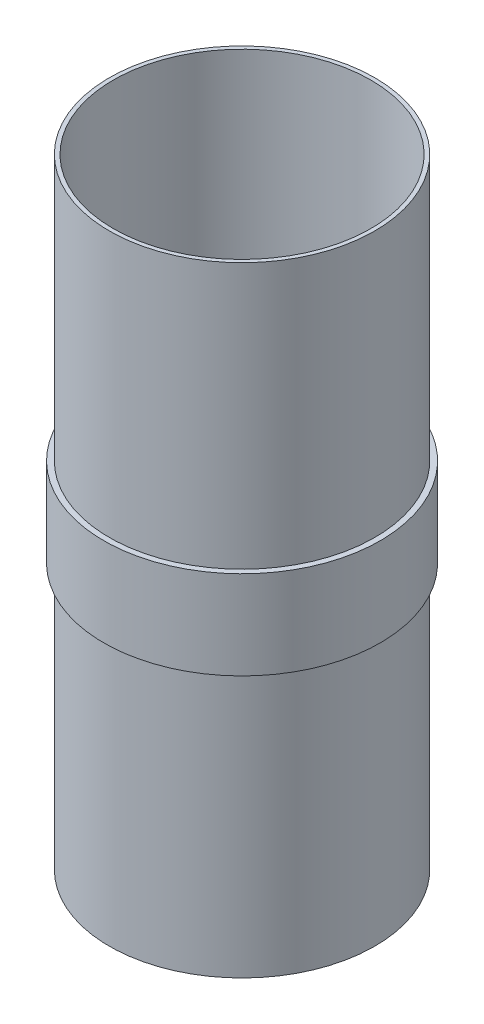
ISO-10303-21;
HEADER;
FILE_DESCRIPTION(('STEP AP214'),'2;1');
FILE_NAME('part.step','',(''),(''),'','','');
FILE_SCHEMA(('AUTOMOTIVE_DESIGN { 1 0 10303 214 1 1 1 1 }'));
ENDSEC;
DATA;
#1=APPLICATION_CONTEXT('core data for automotive mechanical design processes');
#2=APPLICATION_PROTOCOL_DEFINITION('international standard','automotive_design',2000,#1);
#3=PRODUCT_CONTEXT('',#1,'mechanical');
#4=PRODUCT('Part','Part','',(#3));
#5=PRODUCT_RELATED_PRODUCT_CATEGORY('part','',(#4));
#6=PRODUCT_DEFINITION_FORMATION('','',#4);
#7=PRODUCT_DEFINITION_CONTEXT('part definition',#1,'design');
#8=PRODUCT_DEFINITION('design','',#6,#7);
#9=PRODUCT_DEFINITION_SHAPE('','',#8);
#10=(LENGTH_UNIT() NAMED_UNIT(*) SI_UNIT(.MILLI.,.METRE.));
#11=(NAMED_UNIT(*) PLANE_ANGLE_UNIT() SI_UNIT($,.RADIAN.));
#12=(NAMED_UNIT(*) SI_UNIT($,.STERADIAN.) SOLID_ANGLE_UNIT());
#13=UNCERTAINTY_MEASURE_WITH_UNIT(LENGTH_MEASURE(1.E-05),#10,'distance_accuracy_value','');
#14=(GEOMETRIC_REPRESENTATION_CONTEXT(3) GLOBAL_UNCERTAINTY_ASSIGNED_CONTEXT((#13)) GLOBAL_UNIT_ASSIGNED_CONTEXT((#10,
#11,#12)) REPRESENTATION_CONTEXT('',''));
#15=CARTESIAN_POINT('',(0.,0.,0.));
#16=DIRECTION('',(0.,0.,1.));
#17=DIRECTION('',(1.,0.,0.));
#18=AXIS2_PLACEMENT_3D('',#15,#16,#17);
#19=CARTESIAN_POINT('',(73.914,0.,0.));
#20=DIRECTION('',(0.,-1.,0.));
#21=DIRECTION('',(0.,0.,-1.));
#22=AXIS2_PLACEMENT_3D('',#19,#20,#21);
#23=PLANE('',#22);
#24=CARTESIAN_POINT('',(0.,0.,0.));
#25=DIRECTION('',(0.,-1.,0.));
#26=DIRECTION('',(0.,0.,-1.));
#27=AXIS2_PLACEMENT_3D('',#24,#25,#26);
#28=CIRCLE('',#27,76.2);
#29=CARTESIAN_POINT('',(0.,0.,-76.2));
#30=VERTEX_POINT('',#29);
#31=EDGE_CURVE('E10',#30,#30,#28,.T.);
#32=ORIENTED_EDGE('',*,*,#31,.T.);
#33=EDGE_LOOP('',(#32));
#34=FACE_BOUND('',#33,.T.);
#35=CARTESIAN_POINT('',(0.,0.,0.));
#36=DIRECTION('',(0.,-1.,0.));
#37=DIRECTION('',(0.,0.,-1.));
#38=AXIS2_PLACEMENT_3D('',#35,#36,#37);
#39=CIRCLE('',#38,73.914);
#40=CARTESIAN_POINT('',(0.,0.,-73.914));
#41=VERTEX_POINT('',#40);
#42=EDGE_CURVE('E66',#41,#41,#39,.T.);
#43=ORIENTED_EDGE('',*,*,#42,.F.);
#44=EDGE_LOOP('',(#43));
#45=FACE_BOUND('',#44,.T.);
#46=ADVANCED_FACE('F38',(#34,#45),#23,.T.);
#47=CARTESIAN_POINT('',(0.,0.,0.));
#48=DIRECTION('',(0.,-1.,0.));
#49=DIRECTION('',(0.,0.,-1.));
#50=AXIS2_PLACEMENT_3D('',#47,#48,#49);
#51=CYLINDRICAL_SURFACE('',#50,76.2);
#52=CARTESIAN_POINT('',(0.,152.4,0.));
#53=DIRECTION('',(0.,-1.,0.));
#54=DIRECTION('',(0.,0.,-1.));
#55=AXIS2_PLACEMENT_3D('',#52,#53,#54);
#56=CIRCLE('',#55,76.2);
#57=CARTESIAN_POINT('',(0.,152.4,-76.2));
#58=VERTEX_POINT('',#57);
#59=EDGE_CURVE('E44',#58,#58,#56,.T.);
#60=ORIENTED_EDGE('',*,*,#59,.T.);
#61=EDGE_LOOP('',(#60));
#62=FACE_BOUND('',#61,.T.);
#63=ORIENTED_EDGE('',*,*,#31,.F.);
#64=EDGE_LOOP('',(#63));
#65=FACE_BOUND('',#64,.T.);
#66=ADVANCED_FACE('F74',(#62,#65),#51,.T.);
#67=CARTESIAN_POINT('',(76.2,152.4,0.));
#68=DIRECTION('',(0.,-1.,0.));
#69=DIRECTION('',(0.,0.,-1.));
#70=AXIS2_PLACEMENT_3D('',#67,#68,#69);
#71=PLANE('',#70);
#72=CARTESIAN_POINT('',(0.,152.4,0.));
#73=DIRECTION('',(0.,-1.,0.));
#74=DIRECTION('',(0.,0.,-1.));
#75=AXIS2_PLACEMENT_3D('',#72,#73,#74);
#76=CIRCLE('',#75,79.375);
#77=CARTESIAN_POINT('',(0.,152.4,-79.375));
#78=VERTEX_POINT('',#77);
#79=EDGE_CURVE('E48',#78,#78,#76,.T.);
#80=ORIENTED_EDGE('',*,*,#79,.T.);
#81=EDGE_LOOP('',(#80));
#82=FACE_BOUND('',#81,.T.);
#83=ORIENTED_EDGE('',*,*,#59,.F.);
#84=EDGE_LOOP('',(#83));
#85=FACE_BOUND('',#84,.T.);
#86=ADVANCED_FACE('F78',(#82,#85),#71,.T.);
#87=CARTESIAN_POINT('',(0.,0.,0.));
#88=DIRECTION('',(0.,-1.,0.));
#89=DIRECTION('',(0.,0.,-1.));
#90=AXIS2_PLACEMENT_3D('',#87,#88,#89);
#91=CYLINDRICAL_SURFACE('',#90,79.375);
#92=CARTESIAN_POINT('',(0.,203.2,0.));
#93=DIRECTION('',(0.,-1.,0.));
#94=DIRECTION('',(0.,0.,-1.));
#95=AXIS2_PLACEMENT_3D('',#92,#93,#94);
#96=CIRCLE('',#95,79.375);
#97=CARTESIAN_POINT('',(0.,203.2,-79.375));
#98=VERTEX_POINT('',#97);
#99=EDGE_CURVE('E52',#98,#98,#96,.T.);
#100=ORIENTED_EDGE('',*,*,#99,.T.);
#101=EDGE_LOOP('',(#100));
#102=FACE_BOUND('',#101,.T.);
#103=ORIENTED_EDGE('',*,*,#79,.F.);
#104=EDGE_LOOP('',(#103));
#105=FACE_BOUND('',#104,.T.);
#106=ADVANCED_FACE('F82',(#102,#105),#91,.T.);
#107=CARTESIAN_POINT('',(79.375,203.2,0.));
#108=DIRECTION('',(0.,1.,0.));
#109=DIRECTION('',(0.,0.,1.));
#110=AXIS2_PLACEMENT_3D('',#107,#108,#109);
#111=PLANE('',#110);
#112=CARTESIAN_POINT('',(0.,203.2,0.));
#113=DIRECTION('',(0.,-1.,0.));
#114=DIRECTION('',(0.,0.,-1.));
#115=AXIS2_PLACEMENT_3D('',#112,#113,#114);
#116=CIRCLE('',#115,76.2);
#117=CARTESIAN_POINT('',(0.,203.2,-76.2));
#118=VERTEX_POINT('',#117);
#119=EDGE_CURVE('E57',#118,#118,#116,.T.);
#120=ORIENTED_EDGE('',*,*,#119,.T.);
#121=EDGE_LOOP('',(#120));
#122=FACE_BOUND('',#121,.T.);
#123=ORIENTED_EDGE('',*,*,#99,.F.);
#124=EDGE_LOOP('',(#123));
#125=FACE_BOUND('',#124,.T.);
#126=ADVANCED_FACE('F89',(#122,#125),#111,.T.);
#127=CARTESIAN_POINT('',(0.,0.,0.));
#128=DIRECTION('',(0.,-1.,0.));
#129=DIRECTION('',(0.,0.,-1.));
#130=AXIS2_PLACEMENT_3D('',#127,#128,#129);
#131=CYLINDRICAL_SURFACE('',#130,76.2);
#132=CARTESIAN_POINT('',(0.,355.6,0.));
#133=DIRECTION('',(0.,-1.,0.));
#134=DIRECTION('',(0.,0.,-1.));
#135=AXIS2_PLACEMENT_3D('',#132,#133,#134);
#136=CIRCLE('',#135,76.2);
#137=CARTESIAN_POINT('',(0.,355.6,-76.2));
#138=VERTEX_POINT('',#137);
#139=EDGE_CURVE('E60',#138,#138,#136,.T.);
#140=ORIENTED_EDGE('',*,*,#139,.T.);
#141=EDGE_LOOP('',(#140));
#142=FACE_BOUND('',#141,.T.);
#143=ORIENTED_EDGE('',*,*,#119,.F.);
#144=EDGE_LOOP('',(#143));
#145=FACE_BOUND('',#144,.T.);
#146=ADVANCED_FACE('F93',(#142,#145),#131,.T.);
#147=CARTESIAN_POINT('',(76.2,355.6,0.));
#148=DIRECTION('',(0.,1.,0.));
#149=DIRECTION('',(0.,0.,1.));
#150=AXIS2_PLACEMENT_3D('',#147,#148,#149);
#151=PLANE('',#150);
#152=CARTESIAN_POINT('',(0.,355.6,0.));
#153=DIRECTION('',(0.,-1.,0.));
#154=DIRECTION('',(0.,0.,-1.));
#155=AXIS2_PLACEMENT_3D('',#152,#153,#154);
#156=CIRCLE('',#155,73.914);
#157=CARTESIAN_POINT('',(0.,355.6,-73.914));
#158=VERTEX_POINT('',#157);
#159=EDGE_CURVE('E63',#158,#158,#156,.T.);
#160=ORIENTED_EDGE('',*,*,#159,.T.);
#161=EDGE_LOOP('',(#160));
#162=FACE_BOUND('',#161,.T.);
#163=ORIENTED_EDGE('',*,*,#139,.F.);
#164=EDGE_LOOP('',(#163));
#165=FACE_BOUND('',#164,.T.);
#166=ADVANCED_FACE('F97',(#162,#165),#151,.T.);
#167=CARTESIAN_POINT('',(0.,0.,0.));
#168=DIRECTION('',(0.,-1.,0.));
#169=DIRECTION('',(0.,0.,-1.));
#170=AXIS2_PLACEMENT_3D('',#167,#168,#169);
#171=CYLINDRICAL_SURFACE('',#170,73.914);
#172=ORIENTED_EDGE('',*,*,#42,.T.);
#173=EDGE_LOOP('',(#172));
#174=FACE_BOUND('',#173,.T.);
#175=ORIENTED_EDGE('',*,*,#159,.F.);
#176=EDGE_LOOP('',(#175));
#177=FACE_BOUND('',#176,.T.);
#178=ADVANCED_FACE('F70',(#174,#177),#171,.F.);
#179=CLOSED_SHELL('',(#46,#66,#86,#106,#126,#146,#166,#178));
#180=MANIFOLD_SOLID_BREP('B2',#179);
#181=ADVANCED_BREP_SHAPE_REPRESENTATION('',(#18,#180),#14);
#182=SHAPE_DEFINITION_REPRESENTATION(#9,#181);
ENDSEC;
END-ISO-10303-21;
